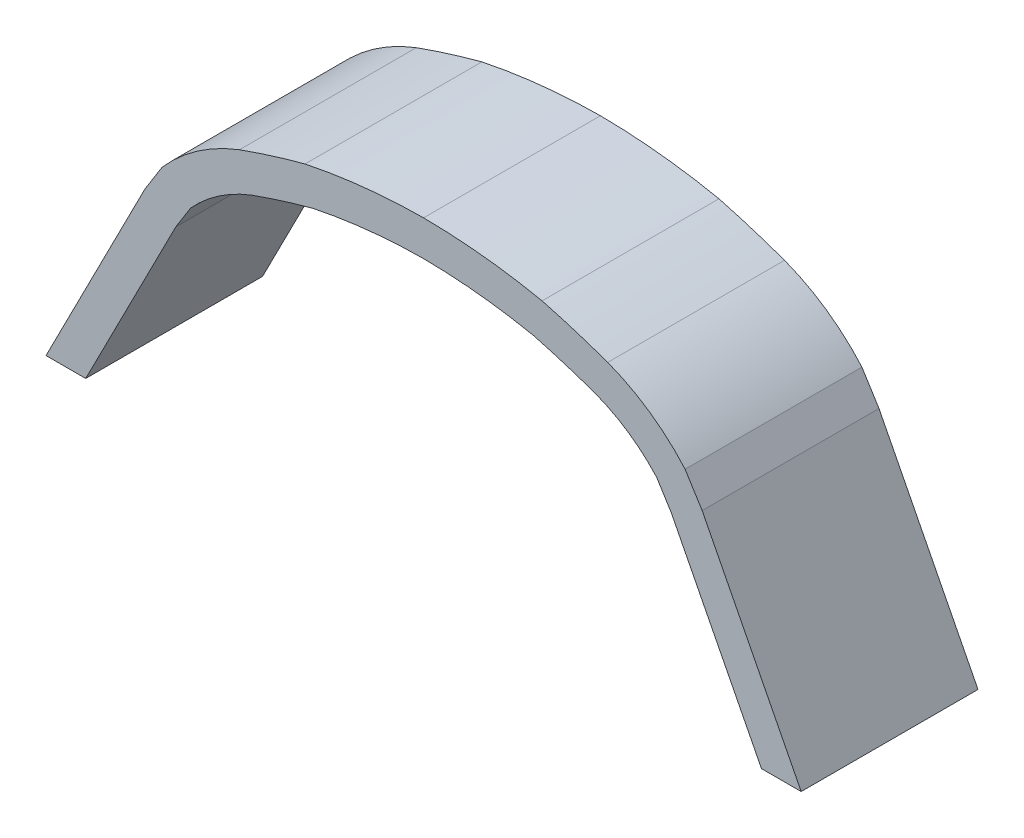
ISO-10303-21;
HEADER;
FILE_DESCRIPTION(('STEP AP214'),'2;1');
FILE_NAME('part.step','',(''),(''),'','','');
FILE_SCHEMA(('AUTOMOTIVE_DESIGN { 1 0 10303 214 1 1 1 1 }'));
ENDSEC;
DATA;
#1=APPLICATION_CONTEXT('core data for automotive mechanical design processes');
#2=APPLICATION_PROTOCOL_DEFINITION('international standard','automotive_design',2000,#1);
#3=PRODUCT_CONTEXT('',#1,'mechanical');
#4=PRODUCT('Part','Part','',(#3));
#5=PRODUCT_RELATED_PRODUCT_CATEGORY('part','',(#4));
#6=PRODUCT_DEFINITION_FORMATION('','',#4);
#7=PRODUCT_DEFINITION_CONTEXT('part definition',#1,'design');
#8=PRODUCT_DEFINITION('design','',#6,#7);
#9=PRODUCT_DEFINITION_SHAPE('','',#8);
#10=(LENGTH_UNIT() NAMED_UNIT(*) SI_UNIT(.MILLI.,.METRE.));
#11=(NAMED_UNIT(*) PLANE_ANGLE_UNIT() SI_UNIT($,.RADIAN.));
#12=(NAMED_UNIT(*) SI_UNIT($,.STERADIAN.) SOLID_ANGLE_UNIT());
#13=UNCERTAINTY_MEASURE_WITH_UNIT(LENGTH_MEASURE(1.E-05),#10,'distance_accuracy_value','');
#14=(GEOMETRIC_REPRESENTATION_CONTEXT(3) GLOBAL_UNCERTAINTY_ASSIGNED_CONTEXT((#13)) GLOBAL_UNIT_ASSIGNED_CONTEXT((#10,
#11,#12)) REPRESENTATION_CONTEXT('',''));
#15=CARTESIAN_POINT('',(0.,0.,0.));
#16=DIRECTION('',(0.,0.,1.));
#17=DIRECTION('',(1.,0.,0.));
#18=AXIS2_PLACEMENT_3D('',#15,#16,#17);
#19=CARTESIAN_POINT('',(-4.8534911742508,0.,2.54));
#20=DIRECTION('',(0.,1.,0.));
#21=DIRECTION('',(-1.,0.,0.));
#22=AXIS2_PLACEMENT_3D('',#19,#20,#21);
#23=PLANE('',#22);
#24=DIRECTION('',(1.,0.,0.));
#25=VECTOR('',#24,1.);
#26=CARTESIAN_POINT('',(-4.8534911742508,0.,0.));
#27=LINE('',#26,#25);
#28=CARTESIAN_POINT('',(-5.42393171380441,0.,0.));
#29=VERTEX_POINT('',#28);
#30=CARTESIAN_POINT('',(-4.8534911742508,0.,0.));
#31=VERTEX_POINT('',#30);
#32=EDGE_CURVE('E219',#29,#31,#27,.T.);
#33=ORIENTED_EDGE('',*,*,#32,.T.);
#34=DIRECTION('',(0.,0.,-1.));
#35=VECTOR('',#34,1.);
#36=CARTESIAN_POINT('',(-4.8534911742508,0.,2.54));
#37=LINE('',#36,#35);
#38=CARTESIAN_POINT('',(-4.8534911742508,0.,2.54));
#39=VERTEX_POINT('',#38);
#40=EDGE_CURVE('E11',#39,#31,#37,.T.);
#41=ORIENTED_EDGE('',*,*,#40,.F.);
#42=DIRECTION('',(1.,0.,0.));
#43=VECTOR('',#42,1.);
#44=CARTESIAN_POINT('',(-4.8534911742508,0.,2.54));
#45=LINE('',#44,#43);
#46=CARTESIAN_POINT('',(-5.42393171380441,0.,2.54));
#47=VERTEX_POINT('',#46);
#48=EDGE_CURVE('E261',#47,#39,#45,.T.);
#49=ORIENTED_EDGE('',*,*,#48,.F.);
#50=DIRECTION('',(0.,0.,-1.));
#51=VECTOR('',#50,1.);
#52=CARTESIAN_POINT('',(-5.42393171380441,0.,2.54));
#53=LINE('',#52,#51);
#54=EDGE_CURVE('E215',#47,#29,#53,.T.);
#55=ORIENTED_EDGE('',*,*,#54,.T.);
#56=EDGE_LOOP('',(#33,#41,#49,#55));
#57=FACE_BOUND('',#56,.T.);
#58=ADVANCED_FACE('F39',(#57),#23,.F.);
#59=CARTESIAN_POINT('',(-4.8534911742508,0.,2.54));
#60=DIRECTION('',(-0.890539792977419,0.454905349631917,0.));
#61=DIRECTION('',(-0.454905349631917,-0.890539792977419,0.));
#62=AXIS2_PLACEMENT_3D('',#59,#60,#61);
#63=PLANE('',#62);
#64=DIRECTION('',(0.454905349631917,0.890539792977419,0.));
#65=VECTOR('',#64,1.);
#66=CARTESIAN_POINT('',(-4.8534911742508,0.,0.));
#67=LINE('',#66,#65);
#68=CARTESIAN_POINT('',(-3.55919919815177,2.53375456978071,0.));
#69=VERTEX_POINT('',#68);
#70=EDGE_CURVE('E222',#31,#69,#67,.T.);
#71=ORIENTED_EDGE('',*,*,#70,.T.);
#72=DIRECTION('',(0.,0.,-1.));
#73=VECTOR('',#72,1.);
#74=CARTESIAN_POINT('',(-3.55919919815177,2.53375456978071,2.54));
#75=LINE('',#74,#73);
#76=CARTESIAN_POINT('',(-3.55919919815177,2.53375456978071,2.54));
#77=VERTEX_POINT('',#76);
#78=EDGE_CURVE('E47',#77,#69,#75,.T.);
#79=ORIENTED_EDGE('',*,*,#78,.F.);
#80=DIRECTION('',(0.454905349631917,0.890539792977419,0.));
#81=VECTOR('',#80,1.);
#82=CARTESIAN_POINT('',(-4.8534911742508,0.,2.54));
#83=LINE('',#82,#81);
#84=EDGE_CURVE('E140',#39,#77,#83,.T.);
#85=ORIENTED_EDGE('',*,*,#84,.F.);
#86=ORIENTED_EDGE('',*,*,#40,.T.);
#87=EDGE_LOOP('',(#71,#79,#85,#86));
#88=FACE_BOUND('',#87,.T.);
#89=ADVANCED_FACE('F389',(#88),#63,.F.);
#90=CARTESIAN_POINT('',(-3.55919919815177,2.53375456978071,2.54));
#91=DIRECTION('',(-0.848020425105594,0.529963544598803,0.));
#92=DIRECTION('',(-0.529963544598803,-0.848020425105594,0.));
#93=AXIS2_PLACEMENT_3D('',#90,#91,#92);
#94=PLANE('',#93);
#95=DIRECTION('',(0.529963544598803,0.848020425105594,0.));
#96=VECTOR('',#95,1.);
#97=CARTESIAN_POINT('',(-3.55919919815177,2.53375456978071,0.));
#98=LINE('',#97,#96);
#99=CARTESIAN_POINT('',(-3.34823027715385,2.87133619382272,0.));
#100=VERTEX_POINT('',#99);
#101=EDGE_CURVE('E224',#69,#100,#98,.T.);
#102=ORIENTED_EDGE('',*,*,#101,.T.);
#103=DIRECTION('',(0.,0.,-1.));
#104=VECTOR('',#103,1.);
#105=CARTESIAN_POINT('',(-3.34823027715385,2.87133619382272,2.54));
#106=LINE('',#105,#104);
#107=CARTESIAN_POINT('',(-3.34823027715385,2.87133619382272,2.54));
#108=VERTEX_POINT('',#107);
#109=EDGE_CURVE('E310',#108,#100,#106,.T.);
#110=ORIENTED_EDGE('',*,*,#109,.F.);
#111=DIRECTION('',(0.529963544598803,0.848020425105594,0.));
#112=VECTOR('',#111,1.);
#113=CARTESIAN_POINT('',(-3.55919919815177,2.53375456978071,2.54));
#114=LINE('',#113,#112);
#115=EDGE_CURVE('E318',#77,#108,#114,.T.);
#116=ORIENTED_EDGE('',*,*,#115,.F.);
#117=ORIENTED_EDGE('',*,*,#78,.T.);
#118=EDGE_LOOP('',(#102,#110,#116,#117));
#119=FACE_BOUND('',#118,.T.);
#120=ADVANCED_FACE('F316',(#119),#94,.F.);
#121=CARTESIAN_POINT('',(-1.65537259777653,1.34136338701031,2.54));
#122=DIRECTION('',(0.,0.,-1.));
#123=DIRECTION('',(-1.,0.,0.));
#124=AXIS2_PLACEMENT_3D('',#121,#122,#123);
#125=CYLINDRICAL_SURFACE('',#124,2.28179401178376);
#126=CARTESIAN_POINT('',(-1.65537259777653,1.34136338701031,0.));
#127=DIRECTION('',(0.,0.,-1.));
#128=DIRECTION('',(-1.,0.,0.));
#129=AXIS2_PLACEMENT_3D('',#126,#127,#128);
#130=CIRCLE('',#129,2.28179401178376);
#131=CARTESIAN_POINT('',(-2.46870060856724,3.47328305225932,0.));
#132=VERTEX_POINT('',#131);
#133=EDGE_CURVE('E226',#100,#132,#130,.T.);
#134=ORIENTED_EDGE('',*,*,#133,.T.);
#135=DIRECTION('',(0.,0.,-1.));
#136=VECTOR('',#135,1.);
#137=CARTESIAN_POINT('',(-2.46870060856724,3.47328305225932,2.54));
#138=LINE('',#137,#136);
#139=CARTESIAN_POINT('',(-2.46870060856724,3.47328305225932,2.54));
#140=VERTEX_POINT('',#139);
#141=EDGE_CURVE('E307',#140,#132,#138,.T.);
#142=ORIENTED_EDGE('',*,*,#141,.F.);
#143=CARTESIAN_POINT('',(-1.65537259777653,1.34136338701031,2.54));
#144=DIRECTION('',(0.,0.,-1.));
#145=DIRECTION('',(-1.,0.,0.));
#146=AXIS2_PLACEMENT_3D('',#143,#144,#145);
#147=CIRCLE('',#146,2.28179401178376);
#148=EDGE_CURVE('E336',#108,#140,#147,.T.);
#149=ORIENTED_EDGE('',*,*,#148,.F.);
#150=ORIENTED_EDGE('',*,*,#109,.T.);
#151=EDGE_LOOP('',(#134,#142,#149,#150));
#152=FACE_BOUND('',#151,.T.);
#153=ADVANCED_FACE('F327',(#152),#125,.F.);
#154=CARTESIAN_POINT('',(1.24806759351382,-6.86046922965072,2.54));
#155=DIRECTION('',(0.,0.,-1.));
#156=DIRECTION('',(-1.,0.,0.));
#157=AXIS2_PLACEMENT_3D('',#154,#155,#156);
#158=CYLINDRICAL_SURFACE('',#157,10.9818396497072);
#159=CARTESIAN_POINT('',(1.24806759351382,-6.86046922965072,0.));
#160=DIRECTION('',(0.,0.,-1.));
#161=DIRECTION('',(-1.,0.,0.));
#162=AXIS2_PLACEMENT_3D('',#159,#160,#161);
#163=CIRCLE('',#162,10.9818396497072);
#164=CARTESIAN_POINT('',(-1.58568086416426,3.74946346431529,0.));
#165=VERTEX_POINT('',#164);
#166=EDGE_CURVE('E228',#132,#165,#163,.T.);
#167=ORIENTED_EDGE('',*,*,#166,.T.);
#168=DIRECTION('',(0.,0.,-1.));
#169=VECTOR('',#168,1.);
#170=CARTESIAN_POINT('',(-1.58568086416426,3.74946346431529,2.54));
#171=LINE('',#170,#169);
#172=CARTESIAN_POINT('',(-1.58568086416426,3.74946346431529,2.54));
#173=VERTEX_POINT('',#172);
#174=EDGE_CURVE('E304',#173,#165,#171,.T.);
#175=ORIENTED_EDGE('',*,*,#174,.F.);
#176=CARTESIAN_POINT('',(1.24806759351382,-6.86046922965072,2.54));
#177=DIRECTION('',(0.,0.,-1.));
#178=DIRECTION('',(-1.,0.,0.));
#179=AXIS2_PLACEMENT_3D('',#176,#177,#178);
#180=CIRCLE('',#179,10.9818396497072);
#181=EDGE_CURVE('E333',#140,#173,#180,.T.);
#182=ORIENTED_EDGE('',*,*,#181,.F.);
#183=ORIENTED_EDGE('',*,*,#141,.T.);
#184=EDGE_LOOP('',(#167,#175,#182,#183));
#185=FACE_BOUND('',#184,.T.);
#186=ADVANCED_FACE('F331',(#185),#158,.F.);
#187=CARTESIAN_POINT('',(0.0630737552409303,-4.24812556363438,2.54));
#188=DIRECTION('',(0.,0.,-1.));
#189=DIRECTION('',(-1.,0.,0.));
#190=AXIS2_PLACEMENT_3D('',#187,#188,#189);
#191=CYLINDRICAL_SURFACE('',#190,8.16577136925784);
#192=CARTESIAN_POINT('',(0.0630737552409303,-4.24812556363438,0.));
#193=DIRECTION('',(0.,0.,-1.));
#194=DIRECTION('',(-1.,0.,0.));
#195=AXIS2_PLACEMENT_3D('',#192,#193,#194);
#196=CIRCLE('',#195,8.16577136925784);
#197=CARTESIAN_POINT('',(0.,3.91740220598289,0.));
#198=VERTEX_POINT('',#197);
#199=EDGE_CURVE('E230',#165,#198,#196,.T.);
#200=ORIENTED_EDGE('',*,*,#199,.T.);
#201=DIRECTION('',(0.,0.,-1.));
#202=VECTOR('',#201,1.);
#203=CARTESIAN_POINT('',(0.,3.91740220598289,2.54));
#204=LINE('',#203,#202);
#205=CARTESIAN_POINT('',(0.,3.91740220598289,2.54));
#206=VERTEX_POINT('',#205);
#207=EDGE_CURVE('E301',#206,#198,#204,.T.);
#208=ORIENTED_EDGE('',*,*,#207,.F.);
#209=CARTESIAN_POINT('',(0.0630737552409303,-4.24812556363438,2.54));
#210=DIRECTION('',(0.,0.,-1.));
#211=DIRECTION('',(-1.,0.,0.));
#212=AXIS2_PLACEMENT_3D('',#209,#210,#211);
#213=CIRCLE('',#212,8.16577136925784);
#214=EDGE_CURVE('E335',#173,#206,#213,.T.);
#215=ORIENTED_EDGE('',*,*,#214,.F.);
#216=ORIENTED_EDGE('',*,*,#174,.T.);
#217=EDGE_LOOP('',(#200,#208,#215,#216));
#218=FACE_BOUND('',#217,.T.);
#219=ADVANCED_FACE('F402',(#218),#191,.F.);
#220=CARTESIAN_POINT('',(-0.0630737552409303,-4.24812556363438,2.54));
#221=DIRECTION('',(0.,0.,-1.));
#222=DIRECTION('',(-1.,0.,0.));
#223=AXIS2_PLACEMENT_3D('',#220,#221,#222);
#224=CYLINDRICAL_SURFACE('',#223,8.16577136925784);
#225=CARTESIAN_POINT('',(-0.0630737552409303,-4.24812556363438,0.));
#226=DIRECTION('',(0.,0.,-1.));
#227=DIRECTION('',(1.,0.,0.));
#228=AXIS2_PLACEMENT_3D('',#225,#226,#227);
#229=CIRCLE('',#228,8.16577136925784);
#230=CARTESIAN_POINT('',(1.58568086416426,3.74946346431529,0.));
#231=VERTEX_POINT('',#230);
#232=EDGE_CURVE('E232',#198,#231,#229,.T.);
#233=ORIENTED_EDGE('',*,*,#232,.T.);
#234=DIRECTION('',(0.,0.,-1.));
#235=VECTOR('',#234,1.);
#236=CARTESIAN_POINT('',(1.58568086416426,3.74946346431529,2.54));
#237=LINE('',#236,#235);
#238=CARTESIAN_POINT('',(1.58568086416426,3.74946346431529,2.54));
#239=VERTEX_POINT('',#238);
#240=EDGE_CURVE('E298',#239,#231,#237,.T.);
#241=ORIENTED_EDGE('',*,*,#240,.F.);
#242=CARTESIAN_POINT('',(-0.0630737552409303,-4.24812556363438,2.54));
#243=DIRECTION('',(0.,0.,-1.));
#244=DIRECTION('',(1.,0.,0.));
#245=AXIS2_PLACEMENT_3D('',#242,#243,#244);
#246=CIRCLE('',#245,8.16577136925784);
#247=EDGE_CURVE('E338',#206,#239,#246,.T.);
#248=ORIENTED_EDGE('',*,*,#247,.F.);
#249=ORIENTED_EDGE('',*,*,#207,.T.);
#250=EDGE_LOOP('',(#233,#241,#248,#249));
#251=FACE_BOUND('',#250,.T.);
#252=ADVANCED_FACE('F405',(#251),#224,.F.);
#253=CARTESIAN_POINT('',(-1.24806759351382,-6.86046922965072,2.54));
#254=DIRECTION('',(0.,0.,-1.));
#255=DIRECTION('',(-1.,0.,0.));
#256=AXIS2_PLACEMENT_3D('',#253,#254,#255);
#257=CYLINDRICAL_SURFACE('',#256,10.9818396497072);
#258=CARTESIAN_POINT('',(-1.24806759351382,-6.86046922965072,0.));
#259=DIRECTION('',(0.,0.,-1.));
#260=DIRECTION('',(1.,0.,0.));
#261=AXIS2_PLACEMENT_3D('',#258,#259,#260);
#262=CIRCLE('',#261,10.9818396497072);
#263=CARTESIAN_POINT('',(2.46870060856725,3.47328305225932,0.));
#264=VERTEX_POINT('',#263);
#265=EDGE_CURVE('E234',#231,#264,#262,.T.);
#266=ORIENTED_EDGE('',*,*,#265,.T.);
#267=DIRECTION('',(0.,0.,-1.));
#268=VECTOR('',#267,1.);
#269=CARTESIAN_POINT('',(2.46870060856725,3.47328305225932,2.54));
#270=LINE('',#269,#268);
#271=CARTESIAN_POINT('',(2.46870060856725,3.47328305225932,2.54));
#272=VERTEX_POINT('',#271);
#273=EDGE_CURVE('E295',#272,#264,#270,.T.);
#274=ORIENTED_EDGE('',*,*,#273,.F.);
#275=CARTESIAN_POINT('',(-1.24806759351382,-6.86046922965072,2.54));
#276=DIRECTION('',(0.,0.,-1.));
#277=DIRECTION('',(1.,0.,0.));
#278=AXIS2_PLACEMENT_3D('',#275,#276,#277);
#279=CIRCLE('',#278,10.9818396497072);
#280=EDGE_CURVE('E344',#239,#272,#279,.T.);
#281=ORIENTED_EDGE('',*,*,#280,.F.);
#282=ORIENTED_EDGE('',*,*,#240,.T.);
#283=EDGE_LOOP('',(#266,#274,#281,#282));
#284=FACE_BOUND('',#283,.T.);
#285=ADVANCED_FACE('F409',(#284),#257,.F.);
#286=CARTESIAN_POINT('',(1.65537259777653,1.34136338701031,2.54));
#287=DIRECTION('',(0.,0.,-1.));
#288=DIRECTION('',(-1.,0.,0.));
#289=AXIS2_PLACEMENT_3D('',#286,#287,#288);
#290=CYLINDRICAL_SURFACE('',#289,2.28179401178376);
#291=CARTESIAN_POINT('',(1.65537259777653,1.34136338701031,0.));
#292=DIRECTION('',(0.,0.,-1.));
#293=DIRECTION('',(1.,0.,0.));
#294=AXIS2_PLACEMENT_3D('',#291,#292,#293);
#295=CIRCLE('',#294,2.28179401178376);
#296=CARTESIAN_POINT('',(3.34823027715385,2.87133619382272,0.));
#297=VERTEX_POINT('',#296);
#298=EDGE_CURVE('E236',#264,#297,#295,.T.);
#299=ORIENTED_EDGE('',*,*,#298,.T.);
#300=DIRECTION('',(0.,0.,-1.));
#301=VECTOR('',#300,1.);
#302=CARTESIAN_POINT('',(3.34823027715385,2.87133619382272,2.54));
#303=LINE('',#302,#301);
#304=CARTESIAN_POINT('',(3.34823027715385,2.87133619382272,2.54));
#305=VERTEX_POINT('',#304);
#306=EDGE_CURVE('E292',#305,#297,#303,.T.);
#307=ORIENTED_EDGE('',*,*,#306,.F.);
#308=CARTESIAN_POINT('',(1.65537259777653,1.34136338701031,2.54));
#309=DIRECTION('',(0.,0.,-1.));
#310=DIRECTION('',(1.,0.,0.));
#311=AXIS2_PLACEMENT_3D('',#308,#309,#310);
#312=CIRCLE('',#311,2.28179401178376);
#313=EDGE_CURVE('E346',#272,#305,#312,.T.);
#314=ORIENTED_EDGE('',*,*,#313,.F.);
#315=ORIENTED_EDGE('',*,*,#273,.T.);
#316=EDGE_LOOP('',(#299,#307,#314,#315));
#317=FACE_BOUND('',#316,.T.);
#318=ADVANCED_FACE('F413',(#317),#290,.F.);
#319=CARTESIAN_POINT('',(3.55919919815177,2.53375456978071,2.54));
#320=DIRECTION('',(0.848020425105594,0.529963544598803,0.));
#321=DIRECTION('',(-0.529963544598803,0.848020425105594,0.));
#322=AXIS2_PLACEMENT_3D('',#319,#320,#321);
#323=PLANE('',#322);
#324=DIRECTION('',(0.529963544598803,-0.848020425105594,0.));
#325=VECTOR('',#324,1.);
#326=CARTESIAN_POINT('',(3.55919919815177,2.53375456978071,0.));
#327=LINE('',#326,#325);
#328=CARTESIAN_POINT('',(3.55919919815177,2.53375456978071,0.));
#329=VERTEX_POINT('',#328);
#330=EDGE_CURVE('E238',#297,#329,#327,.T.);
#331=ORIENTED_EDGE('',*,*,#330,.T.);
#332=DIRECTION('',(0.,0.,-1.));
#333=VECTOR('',#332,1.);
#334=CARTESIAN_POINT('',(3.55919919815177,2.53375456978071,2.54));
#335=LINE('',#334,#333);
#336=CARTESIAN_POINT('',(3.55919919815177,2.53375456978071,2.54));
#337=VERTEX_POINT('',#336);
#338=EDGE_CURVE('E289',#337,#329,#335,.T.);
#339=ORIENTED_EDGE('',*,*,#338,.F.);
#340=DIRECTION('',(0.529963544598803,-0.848020425105594,0.));
#341=VECTOR('',#340,1.);
#342=CARTESIAN_POINT('',(3.55919919815177,2.53375456978071,2.54));
#343=LINE('',#342,#341);
#344=EDGE_CURVE('E348',#305,#337,#343,.T.);
#345=ORIENTED_EDGE('',*,*,#344,.F.);
#346=ORIENTED_EDGE('',*,*,#306,.T.);
#347=EDGE_LOOP('',(#331,#339,#345,#346));
#348=FACE_BOUND('',#347,.T.);
#349=ADVANCED_FACE('F417',(#348),#323,.F.);
#350=CARTESIAN_POINT('',(4.8534911742508,0.,2.54));
#351=DIRECTION('',(0.890539792977419,0.454905349631917,0.));
#352=DIRECTION('',(-0.454905349631917,0.890539792977419,0.));
#353=AXIS2_PLACEMENT_3D('',#350,#351,#352);
#354=PLANE('',#353);
#355=DIRECTION('',(0.454905349631917,-0.890539792977419,0.));
#356=VECTOR('',#355,1.);
#357=CARTESIAN_POINT('',(4.8534911742508,0.,0.));
#358=LINE('',#357,#356);
#359=CARTESIAN_POINT('',(4.8534911742508,0.,0.));
#360=VERTEX_POINT('',#359);
#361=EDGE_CURVE('E240',#329,#360,#358,.T.);
#362=ORIENTED_EDGE('',*,*,#361,.T.);
#363=DIRECTION('',(0.,0.,-1.));
#364=VECTOR('',#363,1.);
#365=CARTESIAN_POINT('',(4.8534911742508,0.,2.54));
#366=LINE('',#365,#364);
#367=CARTESIAN_POINT('',(4.8534911742508,0.,2.54));
#368=VERTEX_POINT('',#367);
#369=EDGE_CURVE('E286',#368,#360,#366,.T.);
#370=ORIENTED_EDGE('',*,*,#369,.F.);
#371=DIRECTION('',(0.454905349631917,-0.890539792977419,0.));
#372=VECTOR('',#371,1.);
#373=CARTESIAN_POINT('',(4.8534911742508,0.,2.54));
#374=LINE('',#373,#372);
#375=EDGE_CURVE('E350',#337,#368,#374,.T.);
#376=ORIENTED_EDGE('',*,*,#375,.F.);
#377=ORIENTED_EDGE('',*,*,#338,.T.);
#378=EDGE_LOOP('',(#362,#370,#376,#377));
#379=FACE_BOUND('',#378,.T.);
#380=ADVANCED_FACE('F421',(#379),#354,.F.);
#381=CARTESIAN_POINT('',(4.8534911742508,0.,2.54));
#382=DIRECTION('',(0.,1.,0.));
#383=DIRECTION('',(-1.,0.,0.));
#384=AXIS2_PLACEMENT_3D('',#381,#382,#383);
#385=PLANE('',#384);
#386=DIRECTION('',(1.,0.,0.));
#387=VECTOR('',#386,1.);
#388=CARTESIAN_POINT('',(4.8534911742508,0.,0.));
#389=LINE('',#388,#387);
#390=CARTESIAN_POINT('',(5.42393171380441,0.,0.));
#391=VERTEX_POINT('',#390);
#392=EDGE_CURVE('E242',#360,#391,#389,.T.);
#393=ORIENTED_EDGE('',*,*,#392,.T.);
#394=DIRECTION('',(0.,0.,-1.));
#395=VECTOR('',#394,1.);
#396=CARTESIAN_POINT('',(5.42393171380441,0.,2.54));
#397=LINE('',#396,#395);
#398=CARTESIAN_POINT('',(5.42393171380441,0.,2.54));
#399=VERTEX_POINT('',#398);
#400=EDGE_CURVE('E283',#399,#391,#397,.T.);
#401=ORIENTED_EDGE('',*,*,#400,.F.);
#402=DIRECTION('',(1.,0.,0.));
#403=VECTOR('',#402,1.);
#404=CARTESIAN_POINT('',(4.8534911742508,0.,2.54));
#405=LINE('',#404,#403);
#406=EDGE_CURVE('E352',#368,#399,#405,.T.);
#407=ORIENTED_EDGE('',*,*,#406,.F.);
#408=ORIENTED_EDGE('',*,*,#369,.T.);
#409=EDGE_LOOP('',(#393,#401,#407,#408));
#410=FACE_BOUND('',#409,.T.);
#411=ADVANCED_FACE('F425',(#410),#385,.F.);
#412=CARTESIAN_POINT('',(5.42393171380441,0.,2.54));
#413=DIRECTION('',(-0.890539792977419,-0.454905349631916,0.));
#414=DIRECTION('',(0.454905349631917,-0.890539792977419,0.));
#415=AXIS2_PLACEMENT_3D('',#412,#413,#414);
#416=PLANE('',#415);
#417=DIRECTION('',(-0.454905349631917,0.890539792977419,0.));
#418=VECTOR('',#417,1.);
#419=CARTESIAN_POINT('',(5.42393171380441,0.,0.));
#420=LINE('',#419,#418);
#421=CARTESIAN_POINT('',(4.0016165700616,2.78437752970426,0.));
#422=VERTEX_POINT('',#421);
#423=EDGE_CURVE('E244',#391,#422,#420,.T.);
#424=ORIENTED_EDGE('',*,*,#423,.T.);
#425=DIRECTION('',(0.,0.,-1.));
#426=VECTOR('',#425,1.);
#427=CARTESIAN_POINT('',(4.0016165700616,2.78437752970426,2.54));
#428=LINE('',#427,#426);
#429=CARTESIAN_POINT('',(4.0016165700616,2.78437752970426,2.54));
#430=VERTEX_POINT('',#429);
#431=EDGE_CURVE('E280',#430,#422,#428,.T.);
#432=ORIENTED_EDGE('',*,*,#431,.F.);
#433=DIRECTION('',(-0.454905349631917,0.890539792977419,0.));
#434=VECTOR('',#433,1.);
#435=CARTESIAN_POINT('',(5.42393171380441,0.,2.54));
#436=LINE('',#435,#434);
#437=EDGE_CURVE('E354',#399,#430,#436,.T.);
#438=ORIENTED_EDGE('',*,*,#437,.F.);
#439=ORIENTED_EDGE('',*,*,#400,.T.);
#440=EDGE_LOOP('',(#424,#432,#438,#439));
#441=FACE_BOUND('',#440,.T.);
#442=ADVANCED_FACE('F429',(#441),#416,.F.);
#443=CARTESIAN_POINT('',(4.0016165700616,2.78437752970426,2.54));
#444=DIRECTION('',(-0.848020425105594,-0.529963544598803,0.));
#445=DIRECTION('',(0.529963544598803,-0.848020425105594,0.));
#446=AXIS2_PLACEMENT_3D('',#443,#444,#445);
#447=PLANE('',#446);
#448=DIRECTION('',(-0.529963544598803,0.848020425105594,0.));
#449=VECTOR('',#448,1.);
#450=CARTESIAN_POINT('',(4.0016165700616,2.78437752970426,0.));
#451=LINE('',#450,#449);
#452=CARTESIAN_POINT('',(3.75642872072315,3.17671452409908,0.));
#453=VERTEX_POINT('',#452);
#454=EDGE_CURVE('E246',#422,#453,#451,.T.);
#455=ORIENTED_EDGE('',*,*,#454,.T.);
#456=DIRECTION('',(0.,0.,-1.));
#457=VECTOR('',#456,1.);
#458=CARTESIAN_POINT('',(3.75642872072315,3.17671452409908,2.54));
#459=LINE('',#458,#457);
#460=CARTESIAN_POINT('',(3.75642872072315,3.17671452409908,2.54));
#461=VERTEX_POINT('',#460);
#462=EDGE_CURVE('E277',#461,#453,#459,.T.);
#463=ORIENTED_EDGE('',*,*,#462,.F.);
#464=DIRECTION('',(-0.529963544598803,0.848020425105594,0.));
#465=VECTOR('',#464,1.);
#466=CARTESIAN_POINT('',(4.0016165700616,2.78437752970426,2.54));
#467=LINE('',#466,#465);
#468=EDGE_CURVE('E356',#430,#461,#467,.T.);
#469=ORIENTED_EDGE('',*,*,#468,.F.);
#470=ORIENTED_EDGE('',*,*,#431,.T.);
#471=EDGE_LOOP('',(#455,#463,#469,#470));
#472=FACE_BOUND('',#471,.T.);
#473=ADVANCED_FACE('F433',(#472),#447,.F.);
#474=CARTESIAN_POINT('',(1.65537259777653,1.34136338701031,2.54));
#475=DIRECTION('',(0.,0.,-1.));
#476=DIRECTION('',(-1.,0.,0.));
#477=AXIS2_PLACEMENT_3D('',#474,#475,#476);
#478=CYLINDRICAL_SURFACE('',#477,2.78979401178376);
#479=CARTESIAN_POINT('',(1.65537259777653,1.34136338701031,0.));
#480=DIRECTION('',(0.,0.,1.));
#481=DIRECTION('',(1.,0.,0.));
#482=AXIS2_PLACEMENT_3D('',#479,#480,#481);
#483=CIRCLE('',#482,2.78979401178376);
#484=CARTESIAN_POINT('',(2.64503978986939,3.94971717380372,0.));
#485=VERTEX_POINT('',#484);
#486=EDGE_CURVE('E248',#453,#485,#483,.T.);
#487=ORIENTED_EDGE('',*,*,#486,.T.);
#488=DIRECTION('',(0.,0.,-1.));
#489=VECTOR('',#488,1.);
#490=CARTESIAN_POINT('',(2.64503978986939,3.94971717380372,2.54));
#491=LINE('',#490,#489);
#492=CARTESIAN_POINT('',(2.64503978986939,3.94971717380372,2.54));
#493=VERTEX_POINT('',#492);
#494=EDGE_CURVE('E274',#493,#485,#491,.T.);
#495=ORIENTED_EDGE('',*,*,#494,.F.);
#496=CARTESIAN_POINT('',(1.65537259777653,1.34136338701031,2.54));
#497=DIRECTION('',(0.,0.,1.));
#498=DIRECTION('',(1.,0.,0.));
#499=AXIS2_PLACEMENT_3D('',#496,#497,#498);
#500=CIRCLE('',#499,2.78979401178376);
#501=EDGE_CURVE('E358',#461,#493,#500,.T.);
#502=ORIENTED_EDGE('',*,*,#501,.F.);
#503=ORIENTED_EDGE('',*,*,#462,.T.);
#504=EDGE_LOOP('',(#487,#495,#502,#503));
#505=FACE_BOUND('',#504,.T.);
#506=ADVANCED_FACE('F437',(#505),#478,.T.);
#507=CARTESIAN_POINT('',(-1.24806759351382,-6.86046922965072,2.54));
#508=DIRECTION('',(0.,0.,-1.));
#509=DIRECTION('',(-1.,0.,0.));
#510=AXIS2_PLACEMENT_3D('',#507,#508,#509);
#511=CYLINDRICAL_SURFACE('',#510,11.4898396497072);
#512=CARTESIAN_POINT('',(-1.24806759351382,-6.86046922965072,0.));
#513=DIRECTION('',(0.,0.,1.));
#514=DIRECTION('',(1.,0.,0.));
#515=AXIS2_PLACEMENT_3D('',#512,#513,#514);
#516=CIRCLE('',#515,11.4898396497072);
#517=CARTESIAN_POINT('',(1.70265686658709,4.24401816673757,0.));
#518=VERTEX_POINT('',#517);
#519=EDGE_CURVE('E250',#485,#518,#516,.T.);
#520=ORIENTED_EDGE('',*,*,#519,.T.);
#521=DIRECTION('',(0.,0.,-1.));
#522=VECTOR('',#521,1.);
#523=CARTESIAN_POINT('',(1.70265686658709,4.24401816673757,2.54));
#524=LINE('',#523,#522);
#525=CARTESIAN_POINT('',(1.70265686658709,4.24401816673757,2.54));
#526=VERTEX_POINT('',#525);
#527=EDGE_CURVE('E271',#526,#518,#524,.T.);
#528=ORIENTED_EDGE('',*,*,#527,.F.);
#529=CARTESIAN_POINT('',(-1.24806759351382,-6.86046922965072,2.54));
#530=DIRECTION('',(0.,0.,1.));
#531=DIRECTION('',(1.,0.,0.));
#532=AXIS2_PLACEMENT_3D('',#529,#530,#531);
#533=CIRCLE('',#532,11.4898396497072);
#534=EDGE_CURVE('E360',#493,#526,#533,.T.);
#535=ORIENTED_EDGE('',*,*,#534,.F.);
#536=ORIENTED_EDGE('',*,*,#494,.T.);
#537=EDGE_LOOP('',(#520,#528,#535,#536));
#538=FACE_BOUND('',#537,.T.);
#539=ADVANCED_FACE('F441',(#538),#511,.T.);
#540=CARTESIAN_POINT('',(-0.0630737552409303,-4.24812556363438,2.54));
#541=DIRECTION('',(0.,0.,-1.));
#542=DIRECTION('',(-1.,0.,0.));
#543=AXIS2_PLACEMENT_3D('',#540,#541,#542);
#544=CYLINDRICAL_SURFACE('',#543,8.67377136925784);
#545=CARTESIAN_POINT('',(-0.0630737552409303,-4.24812556363438,0.));
#546=DIRECTION('',(0.,0.,1.));
#547=DIRECTION('',(1.,0.,0.));
#548=AXIS2_PLACEMENT_3D('',#545,#546,#547);
#549=CIRCLE('',#548,8.67377136925784);
#550=CARTESIAN_POINT('',(0.,4.42541647336277,0.));
#551=VERTEX_POINT('',#550);
#552=EDGE_CURVE('E252',#518,#551,#549,.T.);
#553=ORIENTED_EDGE('',*,*,#552,.T.);
#554=DIRECTION('',(0.,0.,-1.));
#555=VECTOR('',#554,1.);
#556=CARTESIAN_POINT('',(0.,4.42541647336277,2.54));
#557=LINE('',#556,#555);
#558=CARTESIAN_POINT('',(0.,4.42541647336277,2.54));
#559=VERTEX_POINT('',#558);
#560=EDGE_CURVE('E268',#559,#551,#557,.T.);
#561=ORIENTED_EDGE('',*,*,#560,.F.);
#562=CARTESIAN_POINT('',(-0.0630737552409303,-4.24812556363438,2.54));
#563=DIRECTION('',(0.,0.,1.));
#564=DIRECTION('',(1.,0.,0.));
#565=AXIS2_PLACEMENT_3D('',#562,#563,#564);
#566=CIRCLE('',#565,8.67377136925784);
#567=EDGE_CURVE('E362',#526,#559,#566,.T.);
#568=ORIENTED_EDGE('',*,*,#567,.F.);
#569=ORIENTED_EDGE('',*,*,#527,.T.);
#570=EDGE_LOOP('',(#553,#561,#568,#569));
#571=FACE_BOUND('',#570,.T.);
#572=ADVANCED_FACE('F445',(#571),#544,.T.);
#573=CARTESIAN_POINT('',(0.0630737552409303,-4.24812556363438,2.54));
#574=DIRECTION('',(0.,0.,-1.));
#575=DIRECTION('',(-1.,0.,0.));
#576=AXIS2_PLACEMENT_3D('',#573,#574,#575);
#577=CYLINDRICAL_SURFACE('',#576,8.67377136925784);
#578=CARTESIAN_POINT('',(0.0630737552409303,-4.24812556363438,0.));
#579=DIRECTION('',(0.,0.,1.));
#580=DIRECTION('',(-1.,0.,0.));
#581=AXIS2_PLACEMENT_3D('',#578,#579,#580);
#582=CIRCLE('',#581,8.67377136925784);
#583=CARTESIAN_POINT('',(-1.7026568665871,4.24401816673757,0.));
#584=VERTEX_POINT('',#583);
#585=EDGE_CURVE('E254',#551,#584,#582,.T.);
#586=ORIENTED_EDGE('',*,*,#585,.T.);
#587=DIRECTION('',(0.,0.,-1.));
#588=VECTOR('',#587,1.);
#589=CARTESIAN_POINT('',(-1.7026568665871,4.24401816673757,2.54));
#590=LINE('',#589,#588);
#591=CARTESIAN_POINT('',(-1.7026568665871,4.24401816673757,2.54));
#592=VERTEX_POINT('',#591);
#593=EDGE_CURVE('E265',#592,#584,#590,.T.);
#594=ORIENTED_EDGE('',*,*,#593,.F.);
#595=CARTESIAN_POINT('',(0.0630737552409303,-4.24812556363438,2.54));
#596=DIRECTION('',(0.,0.,1.));
#597=DIRECTION('',(-1.,0.,0.));
#598=AXIS2_PLACEMENT_3D('',#595,#596,#597);
#599=CIRCLE('',#598,8.67377136925784);
#600=EDGE_CURVE('E364',#559,#592,#599,.T.);
#601=ORIENTED_EDGE('',*,*,#600,.F.);
#602=ORIENTED_EDGE('',*,*,#560,.T.);
#603=EDGE_LOOP('',(#586,#594,#601,#602));
#604=FACE_BOUND('',#603,.T.);
#605=ADVANCED_FACE('F370',(#604),#577,.T.);
#606=CARTESIAN_POINT('',(1.24806759351382,-6.86046922965072,2.54));
#607=DIRECTION('',(0.,0.,-1.));
#608=DIRECTION('',(-1.,0.,0.));
#609=AXIS2_PLACEMENT_3D('',#606,#607,#608);
#610=CYLINDRICAL_SURFACE('',#609,11.4898396497072);
#611=CARTESIAN_POINT('',(1.24806759351382,-6.86046922965072,0.));
#612=DIRECTION('',(0.,0.,1.));
#613=DIRECTION('',(-1.,0.,0.));
#614=AXIS2_PLACEMENT_3D('',#611,#612,#613);
#615=CIRCLE('',#614,11.4898396497072);
#616=CARTESIAN_POINT('',(-2.64503978986925,3.94971717380378,0.));
#617=VERTEX_POINT('',#616);
#618=EDGE_CURVE('E256',#584,#617,#615,.T.);
#619=ORIENTED_EDGE('',*,*,#618,.T.);
#620=DIRECTION('',(0.,0.,-1.));
#621=VECTOR('',#620,1.);
#622=CARTESIAN_POINT('',(-2.64503978986925,3.94971717380378,2.54));
#623=LINE('',#622,#621);
#624=CARTESIAN_POINT('',(-2.64503978986925,3.94971717380378,2.54));
#625=VERTEX_POINT('',#624);
#626=EDGE_CURVE('E210',#625,#617,#623,.T.);
#627=ORIENTED_EDGE('',*,*,#626,.F.);
#628=CARTESIAN_POINT('',(1.24806759351382,-6.86046922965072,2.54));
#629=DIRECTION('',(0.,0.,1.));
#630=DIRECTION('',(-1.,0.,0.));
#631=AXIS2_PLACEMENT_3D('',#628,#629,#630);
#632=CIRCLE('',#631,11.4898396497072);
#633=EDGE_CURVE('E201',#592,#625,#632,.T.);
#634=ORIENTED_EDGE('',*,*,#633,.F.);
#635=ORIENTED_EDGE('',*,*,#593,.T.);
#636=EDGE_LOOP('',(#619,#627,#634,#635));
#637=FACE_BOUND('',#636,.T.);
#638=ADVANCED_FACE('F374',(#637),#610,.T.);
#639=CARTESIAN_POINT('',(-1.65537259777653,1.34136338701031,2.54));
#640=DIRECTION('',(0.,0.,-1.));
#641=DIRECTION('',(-1.,0.,0.));
#642=AXIS2_PLACEMENT_3D('',#639,#640,#641);
#643=CYLINDRICAL_SURFACE('',#642,2.78979401178376);
#644=CARTESIAN_POINT('',(-1.65537259777653,1.34136338701031,0.));
#645=DIRECTION('',(0.,0.,1.));
#646=DIRECTION('',(-1.,0.,0.));
#647=AXIS2_PLACEMENT_3D('',#644,#645,#646);
#648=CIRCLE('',#647,2.78979401178376);
#649=CARTESIAN_POINT('',(-3.75642872072315,3.17671452409908,0.));
#650=VERTEX_POINT('',#649);
#651=EDGE_CURVE('E209',#617,#650,#648,.T.);
#652=ORIENTED_EDGE('',*,*,#651,.T.);
#653=DIRECTION('',(0.,0.,-1.));
#654=VECTOR('',#653,1.);
#655=CARTESIAN_POINT('',(-3.75642872072315,3.17671452409908,2.54));
#656=LINE('',#655,#654);
#657=CARTESIAN_POINT('',(-3.75642872072315,3.17671452409908,2.54));
#658=VERTEX_POINT('',#657);
#659=EDGE_CURVE('E206',#658,#650,#656,.T.);
#660=ORIENTED_EDGE('',*,*,#659,.F.);
#661=CARTESIAN_POINT('',(-1.65537259777653,1.34136338701031,2.54));
#662=DIRECTION('',(0.,0.,1.));
#663=DIRECTION('',(-1.,0.,0.));
#664=AXIS2_PLACEMENT_3D('',#661,#662,#663);
#665=CIRCLE('',#664,2.78979401178376);
#666=EDGE_CURVE('E195',#625,#658,#665,.T.);
#667=ORIENTED_EDGE('',*,*,#666,.F.);
#668=ORIENTED_EDGE('',*,*,#626,.T.);
#669=EDGE_LOOP('',(#652,#660,#667,#668));
#670=FACE_BOUND('',#669,.T.);
#671=ADVANCED_FACE('F207',(#670),#643,.T.);
#672=CARTESIAN_POINT('',(-4.0016165700616,2.78437752970425,2.54));
#673=DIRECTION('',(0.848020425105594,-0.529963544598802,0.));
#674=DIRECTION('',(0.529963544598802,0.848020425105594,0.));
#675=AXIS2_PLACEMENT_3D('',#672,#673,#674);
#676=PLANE('',#675);
#677=DIRECTION('',(-0.529963544598802,-0.848020425105594,0.));
#678=VECTOR('',#677,1.);
#679=CARTESIAN_POINT('',(-4.0016165700616,2.78437752970425,0.));
#680=LINE('',#679,#678);
#681=CARTESIAN_POINT('',(-4.0016165700616,2.78437752970425,0.));
#682=VERTEX_POINT('',#681);
#683=EDGE_CURVE('E126',#650,#682,#680,.T.);
#684=ORIENTED_EDGE('',*,*,#683,.T.);
#685=DIRECTION('',(0.,0.,-1.));
#686=VECTOR('',#685,1.);
#687=CARTESIAN_POINT('',(-4.0016165700616,2.78437752970425,2.54));
#688=LINE('',#687,#686);
#689=CARTESIAN_POINT('',(-4.0016165700616,2.78437752970425,2.54));
#690=VERTEX_POINT('',#689);
#691=EDGE_CURVE('E211',#690,#682,#688,.T.);
#692=ORIENTED_EDGE('',*,*,#691,.F.);
#693=DIRECTION('',(-0.529963544598802,-0.848020425105594,0.));
#694=VECTOR('',#693,1.);
#695=CARTESIAN_POINT('',(-4.0016165700616,2.78437752970425,2.54));
#696=LINE('',#695,#694);
#697=EDGE_CURVE('E199',#658,#690,#696,.T.);
#698=ORIENTED_EDGE('',*,*,#697,.F.);
#699=ORIENTED_EDGE('',*,*,#659,.T.);
#700=EDGE_LOOP('',(#684,#692,#698,#699));
#701=FACE_BOUND('',#700,.T.);
#702=ADVANCED_FACE('F213',(#701),#676,.F.);
#703=CARTESIAN_POINT('',(-5.42393171380441,0.,2.54));
#704=DIRECTION('',(0.890539792977419,-0.454905349631916,0.));
#705=DIRECTION('',(0.454905349631917,0.890539792977419,0.));
#706=AXIS2_PLACEMENT_3D('',#703,#704,#705);
#707=PLANE('',#706);
#708=DIRECTION('',(-0.454905349631917,-0.890539792977419,0.));
#709=VECTOR('',#708,1.);
#710=CARTESIAN_POINT('',(-5.42393171380441,0.,0.));
#711=LINE('',#710,#709);
#712=EDGE_CURVE('E132',#682,#29,#711,.T.);
#713=ORIENTED_EDGE('',*,*,#712,.T.);
#714=ORIENTED_EDGE('',*,*,#54,.F.);
#715=DIRECTION('',(-0.454905349631917,-0.890539792977419,0.));
#716=VECTOR('',#715,1.);
#717=CARTESIAN_POINT('',(-5.42393171380441,0.,2.54));
#718=LINE('',#717,#716);
#719=EDGE_CURVE('E55',#690,#47,#718,.T.);
#720=ORIENTED_EDGE('',*,*,#719,.F.);
#721=ORIENTED_EDGE('',*,*,#691,.T.);
#722=EDGE_LOOP('',(#713,#714,#720,#721));
#723=FACE_BOUND('',#722,.T.);
#724=ADVANCED_FACE('F378',(#723),#707,.F.);
#725=CARTESIAN_POINT('',(-1.65537259777653,1.34136338701031,2.54));
#726=DIRECTION('',(0.,0.,-1.));
#727=DIRECTION('',(-1.,0.,0.));
#728=AXIS2_PLACEMENT_3D('',#725,#726,#727);
#729=PLANE('',#728);
#730=ORIENTED_EDGE('',*,*,#48,.T.);
#731=ORIENTED_EDGE('',*,*,#84,.T.);
#732=ORIENTED_EDGE('',*,*,#115,.T.);
#733=ORIENTED_EDGE('',*,*,#148,.T.);
#734=ORIENTED_EDGE('',*,*,#181,.T.);
#735=ORIENTED_EDGE('',*,*,#214,.T.);
#736=ORIENTED_EDGE('',*,*,#247,.T.);
#737=ORIENTED_EDGE('',*,*,#280,.T.);
#738=ORIENTED_EDGE('',*,*,#313,.T.);
#739=ORIENTED_EDGE('',*,*,#344,.T.);
#740=ORIENTED_EDGE('',*,*,#375,.T.);
#741=ORIENTED_EDGE('',*,*,#406,.T.);
#742=ORIENTED_EDGE('',*,*,#437,.T.);
#743=ORIENTED_EDGE('',*,*,#468,.T.);
#744=ORIENTED_EDGE('',*,*,#501,.T.);
#745=ORIENTED_EDGE('',*,*,#534,.T.);
#746=ORIENTED_EDGE('',*,*,#567,.T.);
#747=ORIENTED_EDGE('',*,*,#600,.T.);
#748=ORIENTED_EDGE('',*,*,#633,.T.);
#749=ORIENTED_EDGE('',*,*,#666,.T.);
#750=ORIENTED_EDGE('',*,*,#697,.T.);
#751=ORIENTED_EDGE('',*,*,#719,.T.);
#752=EDGE_LOOP('',(#730,#731,#732,#733,#734,#735,#736,#737,#738,#739,#740,#741,#742,#743,#744,
#745,#746,#747,#748,#749,#750,#751));
#753=FACE_BOUND('',#752,.T.);
#754=ADVANCED_FACE('F197',(#753),#729,.F.);
#755=CARTESIAN_POINT('',(-1.65537259777653,1.34136338701031,0.));
#756=DIRECTION('',(0.,0.,-1.));
#757=DIRECTION('',(-1.,0.,0.));
#758=AXIS2_PLACEMENT_3D('',#755,#756,#757);
#759=PLANE('',#758);
#760=ORIENTED_EDGE('',*,*,#32,.F.);
#761=ORIENTED_EDGE('',*,*,#712,.F.);
#762=ORIENTED_EDGE('',*,*,#683,.F.);
#763=ORIENTED_EDGE('',*,*,#651,.F.);
#764=ORIENTED_EDGE('',*,*,#618,.F.);
#765=ORIENTED_EDGE('',*,*,#585,.F.);
#766=ORIENTED_EDGE('',*,*,#552,.F.);
#767=ORIENTED_EDGE('',*,*,#519,.F.);
#768=ORIENTED_EDGE('',*,*,#486,.F.);
#769=ORIENTED_EDGE('',*,*,#454,.F.);
#770=ORIENTED_EDGE('',*,*,#423,.F.);
#771=ORIENTED_EDGE('',*,*,#392,.F.);
#772=ORIENTED_EDGE('',*,*,#361,.F.);
#773=ORIENTED_EDGE('',*,*,#330,.F.);
#774=ORIENTED_EDGE('',*,*,#298,.F.);
#775=ORIENTED_EDGE('',*,*,#265,.F.);
#776=ORIENTED_EDGE('',*,*,#232,.F.);
#777=ORIENTED_EDGE('',*,*,#199,.F.);
#778=ORIENTED_EDGE('',*,*,#166,.F.);
#779=ORIENTED_EDGE('',*,*,#133,.F.);
#780=ORIENTED_EDGE('',*,*,#101,.F.);
#781=ORIENTED_EDGE('',*,*,#70,.F.);
#782=EDGE_LOOP('',(#760,#761,#762,#763,#764,#765,#766,#767,#768,#769,#770,#771,#772,#773,#774,
#775,#776,#777,#778,#779,#780,#781));
#783=FACE_BOUND('',#782,.T.);
#784=ADVANCED_FACE('F322',(#783),#759,.T.);
#785=CLOSED_SHELL('',(#58,#89,#120,#153,#186,#219,#252,#285,#318,#349,#380,#411,#442,#473,#506,
#539,#572,#605,#638,#671,#702,#724,#754,#784));
#786=MANIFOLD_SOLID_BREP('B2',#785);
#787=ADVANCED_BREP_SHAPE_REPRESENTATION('',(#18,#786),#14);
#788=SHAPE_DEFINITION_REPRESENTATION(#9,#787);
ENDSEC;
END-ISO-10303-21;
